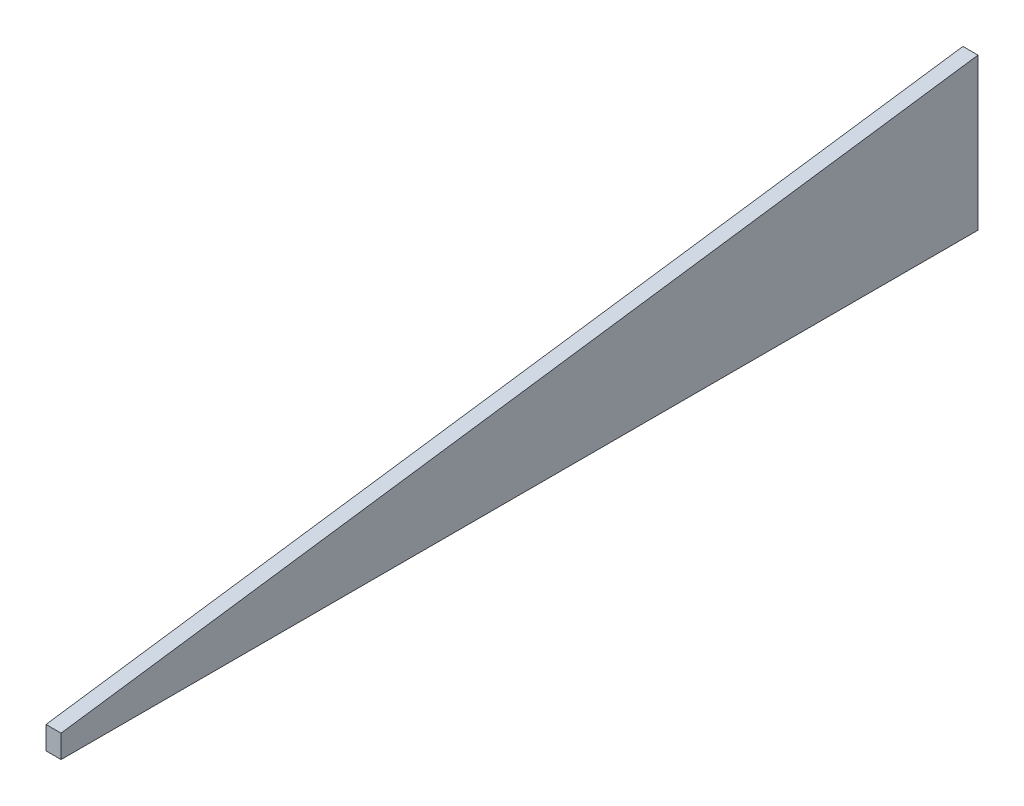
ISO-10303-21;
HEADER;
FILE_DESCRIPTION(('STEP AP214'),'2;1');
FILE_NAME('part.step','',(''),(''),'','','');
FILE_SCHEMA(('AUTOMOTIVE_DESIGN { 1 0 10303 214 1 1 1 1 }'));
ENDSEC;
DATA;
#1=APPLICATION_CONTEXT('core data for automotive mechanical design processes');
#2=APPLICATION_PROTOCOL_DEFINITION('international standard','automotive_design',2000,#1);
#3=PRODUCT_CONTEXT('',#1,'mechanical');
#4=PRODUCT('Part','Part','',(#3));
#5=PRODUCT_RELATED_PRODUCT_CATEGORY('part','',(#4));
#6=PRODUCT_DEFINITION_FORMATION('','',#4);
#7=PRODUCT_DEFINITION_CONTEXT('part definition',#1,'design');
#8=PRODUCT_DEFINITION('design','',#6,#7);
#9=PRODUCT_DEFINITION_SHAPE('','',#8);
#10=(LENGTH_UNIT() NAMED_UNIT(*) SI_UNIT(.MILLI.,.METRE.));
#11=(NAMED_UNIT(*) PLANE_ANGLE_UNIT() SI_UNIT($,.RADIAN.));
#12=(NAMED_UNIT(*) SI_UNIT($,.STERADIAN.) SOLID_ANGLE_UNIT());
#13=UNCERTAINTY_MEASURE_WITH_UNIT(LENGTH_MEASURE(1.E-05),#10,'distance_accuracy_value','');
#14=(GEOMETRIC_REPRESENTATION_CONTEXT(3) GLOBAL_UNCERTAINTY_ASSIGNED_CONTEXT((#13)) GLOBAL_UNIT_ASSIGNED_CONTEXT((#10,
#11,#12)) REPRESENTATION_CONTEXT('',''));
#15=CARTESIAN_POINT('',(0.,0.,0.));
#16=DIRECTION('',(0.,0.,1.));
#17=DIRECTION('',(1.,0.,0.));
#18=AXIS2_PLACEMENT_3D('',#15,#16,#17);
#19=CARTESIAN_POINT('',(0.,0.,47.3970452561136));
#20=DIRECTION('',(-1.,0.,0.));
#21=DIRECTION('',(0.,0.,1.));
#22=AXIS2_PLACEMENT_3D('',#19,#20,#21);
#23=PLANE('',#22);
#24=DIRECTION('',(0.,1.,0.));
#25=VECTOR('',#24,1.);
#26=CARTESIAN_POINT('',(0.,0.,820.2422));
#27=LINE('',#26,#25);
#28=CARTESIAN_POINT('',(0.,19.3170004056174,820.2422));
#29=VERTEX_POINT('',#28);
#30=CARTESIAN_POINT('',(0.,0.,820.2422));
#31=VERTEX_POINT('',#30);
#32=EDGE_CURVE('E20',#29,#31,#27,.F.);
#33=ORIENTED_EDGE('',*,*,#32,.F.);
#34=DIRECTION('',(0.,0.139030064305303,-0.990288160698321));
#35=VECTOR('',#34,1.);
#36=CARTESIAN_POINT('',(0.,134.7216,-1.76568181667756));
#37=LINE('',#36,#35);
#38=CARTESIAN_POINT('',(0.,127.819470521306,47.3970452561138));
#39=VERTEX_POINT('',#38);
#40=EDGE_CURVE('E81',#29,#39,#37,.T.);
#41=ORIENTED_EDGE('',*,*,#40,.T.);
#42=DIRECTION('',(0.,1.,0.));
#43=VECTOR('',#42,1.);
#44=CARTESIAN_POINT('',(0.,0.,47.3970452561136));
#45=LINE('',#44,#43);
#46=CARTESIAN_POINT('',(0.,0.,47.3970452561136));
#47=VERTEX_POINT('',#46);
#48=EDGE_CURVE('E61',#47,#39,#45,.T.);
#49=ORIENTED_EDGE('',*,*,#48,.F.);
#50=DIRECTION('',(0.,0.,1.));
#51=VECTOR('',#50,1.);
#52=CARTESIAN_POINT('',(0.,0.,0.));
#53=LINE('',#52,#51);
#54=EDGE_CURVE('E55',#47,#31,#53,.T.);
#55=ORIENTED_EDGE('',*,*,#54,.T.);
#56=EDGE_LOOP('',(#33,#41,#49,#55));
#57=FACE_BOUND('',#56,.T.);
#58=ADVANCED_FACE('F17',(#57),#23,.T.);
#59=CARTESIAN_POINT('',(0.,0.,820.2422));
#60=DIRECTION('',(0.,0.,1.));
#61=DIRECTION('',(1.,0.,0.));
#62=AXIS2_PLACEMENT_3D('',#59,#60,#61);
#63=PLANE('',#62);
#64=DIRECTION('',(0.,1.,0.));
#65=VECTOR('',#64,1.);
#66=CARTESIAN_POINT('',(12.7,0.,820.2422));
#67=LINE('',#66,#65);
#68=CARTESIAN_POINT('',(12.7,19.3170004056175,820.2422));
#69=VERTEX_POINT('',#68);
#70=CARTESIAN_POINT('',(12.7,0.,820.2422));
#71=VERTEX_POINT('',#70);
#72=EDGE_CURVE('E83',#69,#71,#67,.F.);
#73=ORIENTED_EDGE('',*,*,#72,.F.);
#74=DIRECTION('',(1.,0.,0.));
#75=VECTOR('',#74,1.);
#76=CARTESIAN_POINT('',(0.,19.3170004056261,820.242200000002));
#77=LINE('',#76,#75);
#78=EDGE_CURVE('E68',#69,#29,#77,.F.);
#79=ORIENTED_EDGE('',*,*,#78,.T.);
#80=ORIENTED_EDGE('',*,*,#32,.T.);
#81=DIRECTION('',(1.,0.,0.));
#82=VECTOR('',#81,1.);
#83=CARTESIAN_POINT('',(0.,0.,820.2422));
#84=LINE('',#83,#82);
#85=EDGE_CURVE('E63',#31,#71,#84,.T.);
#86=ORIENTED_EDGE('',*,*,#85,.T.);
#87=EDGE_LOOP('',(#73,#79,#80,#86));
#88=FACE_BOUND('',#87,.T.);
#89=ADVANCED_FACE('F65',(#88),#63,.T.);
#90=CARTESIAN_POINT('',(0.,0.,0.));
#91=DIRECTION('',(0.,1.,0.));
#92=DIRECTION('',(0.,0.,1.));
#93=AXIS2_PLACEMENT_3D('',#90,#91,#92);
#94=PLANE('',#93);
#95=DIRECTION('',(0.,0.,-1.));
#96=VECTOR('',#95,1.);
#97=CARTESIAN_POINT('',(12.7,0.,820.2422));
#98=LINE('',#97,#96);
#99=CARTESIAN_POINT('',(12.7,0.,47.3970452561136));
#100=VERTEX_POINT('',#99);
#101=EDGE_CURVE('E72',#71,#100,#98,.T.);
#102=ORIENTED_EDGE('',*,*,#101,.F.);
#103=ORIENTED_EDGE('',*,*,#85,.F.);
#104=ORIENTED_EDGE('',*,*,#54,.F.);
#105=DIRECTION('',(-1.,0.,0.));
#106=VECTOR('',#105,1.);
#107=CARTESIAN_POINT('',(12.7,0.,47.3970452561136));
#108=LINE('',#107,#106);
#109=EDGE_CURVE('E74',#100,#47,#108,.T.);
#110=ORIENTED_EDGE('',*,*,#109,.F.);
#111=EDGE_LOOP('',(#102,#103,#104,#110));
#112=FACE_BOUND('',#111,.T.);
#113=ADVANCED_FACE('F70',(#112),#94,.F.);
#114=CARTESIAN_POINT('',(12.7,0.,47.3970452561136));
#115=DIRECTION('',(0.,0.,-1.));
#116=DIRECTION('',(-1.,0.,0.));
#117=AXIS2_PLACEMENT_3D('',#114,#115,#116);
#118=PLANE('',#117);
#119=ORIENTED_EDGE('',*,*,#48,.T.);
#120=DIRECTION('',(1.,0.,0.));
#121=VECTOR('',#120,1.);
#122=CARTESIAN_POINT('',(0.,127.819470521309,47.3970452561143));
#123=LINE('',#122,#121);
#124=CARTESIAN_POINT('',(12.7,127.819470521306,47.3970452561138));
#125=VERTEX_POINT('',#124);
#126=EDGE_CURVE('E35',#39,#125,#123,.T.);
#127=ORIENTED_EDGE('',*,*,#126,.T.);
#128=DIRECTION('',(0.,1.,0.));
#129=VECTOR('',#128,1.);
#130=CARTESIAN_POINT('',(12.7,0.,47.3970452561135));
#131=LINE('',#130,#129);
#132=EDGE_CURVE('E26',#100,#125,#131,.T.);
#133=ORIENTED_EDGE('',*,*,#132,.F.);
#134=ORIENTED_EDGE('',*,*,#109,.T.);
#135=EDGE_LOOP('',(#119,#127,#133,#134));
#136=FACE_BOUND('',#135,.T.);
#137=ADVANCED_FACE('F89',(#136),#118,.T.);
#138=CARTESIAN_POINT('',(0.,134.7216,-1.76568181667756));
#139=DIRECTION('',(0.,-0.990288160698321,-0.139030064305303));
#140=DIRECTION('',(0.,0.139030064305303,-0.990288160698321));
#141=AXIS2_PLACEMENT_3D('',#138,#139,#140);
#142=PLANE('',#141);
#143=ORIENTED_EDGE('',*,*,#78,.F.);
#144=DIRECTION('',(0.,-0.139030064305312,0.99028816069832));
#145=VECTOR('',#144,1.);
#146=CARTESIAN_POINT('',(12.7,127.819470521305,47.3970452561135));
#147=LINE('',#146,#145);
#148=EDGE_CURVE('E11',#125,#69,#147,.T.);
#149=ORIENTED_EDGE('',*,*,#148,.F.);
#150=ORIENTED_EDGE('',*,*,#126,.F.);
#151=ORIENTED_EDGE('',*,*,#40,.F.);
#152=EDGE_LOOP('',(#143,#149,#150,#151));
#153=FACE_BOUND('',#152,.T.);
#154=ADVANCED_FACE('F91',(#153),#142,.F.);
#155=CARTESIAN_POINT('',(12.7,0.,820.2422));
#156=DIRECTION('',(1.,0.,0.));
#157=DIRECTION('',(0.,0.,-1.));
#158=AXIS2_PLACEMENT_3D('',#155,#156,#157);
#159=PLANE('',#158);
#160=ORIENTED_EDGE('',*,*,#132,.T.);
#161=ORIENTED_EDGE('',*,*,#148,.T.);
#162=ORIENTED_EDGE('',*,*,#72,.T.);
#163=ORIENTED_EDGE('',*,*,#101,.T.);
#164=EDGE_LOOP('',(#160,#161,#162,#163));
#165=FACE_BOUND('',#164,.T.);
#166=ADVANCED_FACE('F88',(#165),#159,.T.);
#167=CLOSED_SHELL('',(#58,#89,#113,#137,#154,#166));
#168=MANIFOLD_SOLID_BREP('B1',#167);
#169=ADVANCED_BREP_SHAPE_REPRESENTATION('',(#18,#168),#14);
#170=SHAPE_DEFINITION_REPRESENTATION(#9,#169);
ENDSEC;
END-ISO-10303-21;
